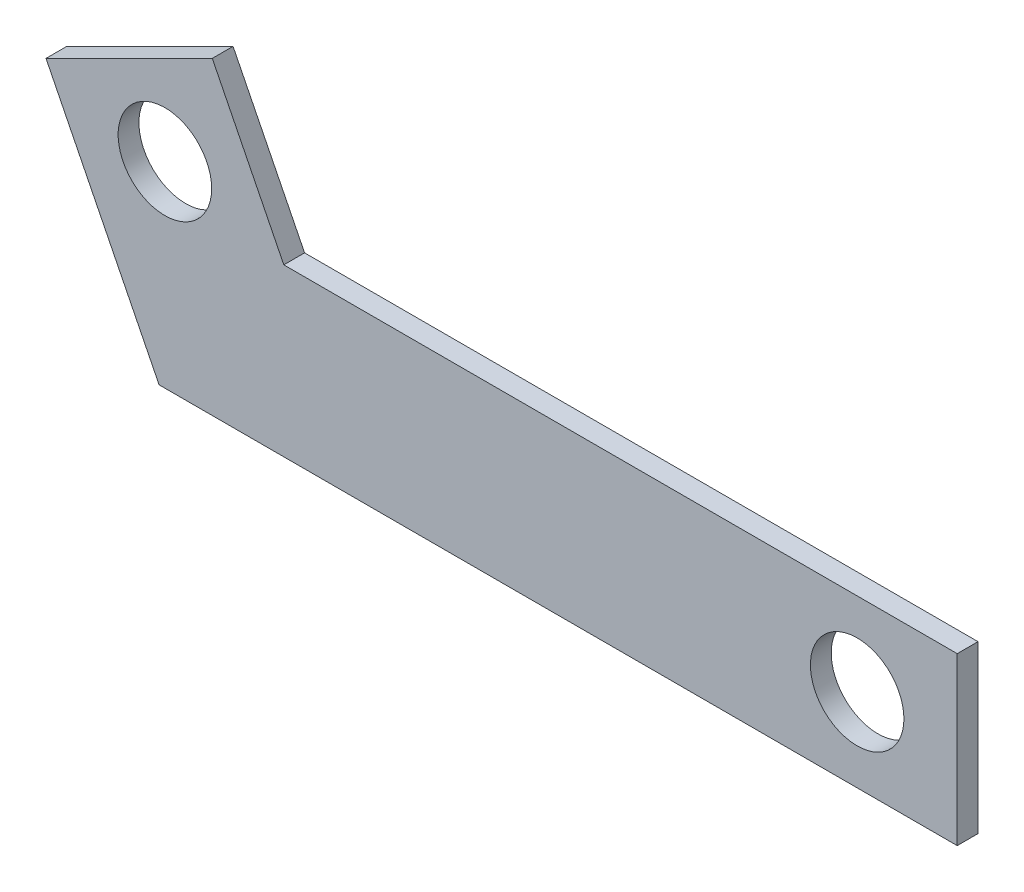
ISO-10303-21;
HEADER;
FILE_DESCRIPTION(('STEP AP214'),'2;1');
FILE_NAME('part.step','',(''),(''),'','','');
FILE_SCHEMA(('AUTOMOTIVE_DESIGN { 1 0 10303 214 1 1 1 1 }'));
ENDSEC;
DATA;
#1=APPLICATION_CONTEXT('core data for automotive mechanical design processes');
#2=APPLICATION_PROTOCOL_DEFINITION('international standard','automotive_design',2000,#1);
#3=PRODUCT_CONTEXT('',#1,'mechanical');
#4=PRODUCT('Part','Part','',(#3));
#5=PRODUCT_RELATED_PRODUCT_CATEGORY('part','',(#4));
#6=PRODUCT_DEFINITION_FORMATION('','',#4);
#7=PRODUCT_DEFINITION_CONTEXT('part definition',#1,'design');
#8=PRODUCT_DEFINITION('design','',#6,#7);
#9=PRODUCT_DEFINITION_SHAPE('','',#8);
#10=(LENGTH_UNIT() NAMED_UNIT(*) SI_UNIT(.MILLI.,.METRE.));
#11=(NAMED_UNIT(*) PLANE_ANGLE_UNIT() SI_UNIT($,.RADIAN.));
#12=(NAMED_UNIT(*) SI_UNIT($,.STERADIAN.) SOLID_ANGLE_UNIT());
#13=UNCERTAINTY_MEASURE_WITH_UNIT(LENGTH_MEASURE(1.E-05),#10,'distance_accuracy_value','');
#14=(GEOMETRIC_REPRESENTATION_CONTEXT(3) GLOBAL_UNCERTAINTY_ASSIGNED_CONTEXT((#13)) GLOBAL_UNIT_ASSIGNED_CONTEXT((#10,
#11,#12)) REPRESENTATION_CONTEXT('',''));
#15=CARTESIAN_POINT('',(0.,0.,0.));
#16=DIRECTION('',(0.,0.,1.));
#17=DIRECTION('',(1.,0.,0.));
#18=AXIS2_PLACEMENT_3D('',#15,#16,#17);
#19=CARTESIAN_POINT('',(104.05726693386,36.9026634810684,6.35));
#20=DIRECTION('',(0.,1.,0.));
#21=DIRECTION('',(-1.,0.,0.));
#22=AXIS2_PLACEMENT_3D('',#19,#20,#21);
#23=PLANE('',#22);
#24=DIRECTION('',(1.,0.,0.));
#25=VECTOR('',#24,1.);
#26=CARTESIAN_POINT('',(104.05726693386,36.9026634810684,0.));
#27=LINE('',#26,#25);
#28=CARTESIAN_POINT('',(-139.78273306614,36.9026634810684,0.));
#29=VERTEX_POINT('',#28);
#30=CARTESIAN_POINT('',(104.05726693386,36.9026634810684,0.));
#31=VERTEX_POINT('',#30);
#32=EDGE_CURVE('E128',#29,#31,#27,.T.);
#33=ORIENTED_EDGE('',*,*,#32,.T.);
#34=DIRECTION('',(0.,0.,-1.));
#35=VECTOR('',#34,1.);
#36=CARTESIAN_POINT('',(104.05726693386,36.9026634810684,6.35));
#37=LINE('',#36,#35);
#38=CARTESIAN_POINT('',(104.05726693386,36.9026634810684,6.35));
#39=VERTEX_POINT('',#38);
#40=EDGE_CURVE('E11',#39,#31,#37,.T.);
#41=ORIENTED_EDGE('',*,*,#40,.F.);
#42=DIRECTION('',(1.,0.,0.));
#43=VECTOR('',#42,1.);
#44=CARTESIAN_POINT('',(104.05726693386,36.9026634810684,6.35));
#45=LINE('',#44,#43);
#46=CARTESIAN_POINT('',(-139.78273306614,36.9026634810684,6.35));
#47=VERTEX_POINT('',#46);
#48=EDGE_CURVE('E145',#47,#39,#45,.T.);
#49=ORIENTED_EDGE('',*,*,#48,.F.);
#50=DIRECTION('',(0.,0.,-1.));
#51=VECTOR('',#50,1.);
#52=CARTESIAN_POINT('',(-139.78273306614,36.9026634810684,6.35));
#53=LINE('',#52,#51);
#54=EDGE_CURVE('E124',#47,#29,#53,.T.);
#55=ORIENTED_EDGE('',*,*,#54,.T.);
#56=EDGE_LOOP('',(#33,#41,#49,#55));
#57=FACE_BOUND('',#56,.T.);
#58=ADVANCED_FACE('F39',(#57),#23,.F.);
#59=CARTESIAN_POINT('',(104.05726693386,87.7026634810684,6.35));
#60=DIRECTION('',(-1.,0.,0.));
#61=DIRECTION('',(0.,-1.,0.));
#62=AXIS2_PLACEMENT_3D('',#59,#60,#61);
#63=PLANE('',#62);
#64=DIRECTION('',(0.,1.,0.));
#65=VECTOR('',#64,1.);
#66=CARTESIAN_POINT('',(104.05726693386,87.7026634810684,0.));
#67=LINE('',#66,#65);
#68=CARTESIAN_POINT('',(104.05726693386,87.7026634810684,0.));
#69=VERTEX_POINT('',#68);
#70=EDGE_CURVE('E132',#31,#69,#67,.T.);
#71=ORIENTED_EDGE('',*,*,#70,.T.);
#72=DIRECTION('',(0.,0.,-1.));
#73=VECTOR('',#72,1.);
#74=CARTESIAN_POINT('',(104.05726693386,87.7026634810684,6.35));
#75=LINE('',#74,#73);
#76=CARTESIAN_POINT('',(104.05726693386,87.7026634810684,6.35));
#77=VERTEX_POINT('',#76);
#78=EDGE_CURVE('E48',#77,#69,#75,.T.);
#79=ORIENTED_EDGE('',*,*,#78,.F.);
#80=DIRECTION('',(0.,1.,0.));
#81=VECTOR('',#80,1.);
#82=CARTESIAN_POINT('',(104.05726693386,87.7026634810684,6.35));
#83=LINE('',#82,#81);
#84=EDGE_CURVE('E93',#39,#77,#83,.T.);
#85=ORIENTED_EDGE('',*,*,#84,.F.);
#86=ORIENTED_EDGE('',*,*,#40,.T.);
#87=EDGE_LOOP('',(#71,#79,#85,#86));
#88=FACE_BOUND('',#87,.T.);
#89=ADVANCED_FACE('F174',(#88),#63,.F.);
#90=CARTESIAN_POINT('',(-101.68273306614,87.7026634810684,6.35));
#91=DIRECTION('',(0.,-1.,0.));
#92=DIRECTION('',(1.,0.,0.));
#93=AXIS2_PLACEMENT_3D('',#90,#91,#92);
#94=PLANE('',#93);
#95=DIRECTION('',(-1.,0.,0.));
#96=VECTOR('',#95,1.);
#97=CARTESIAN_POINT('',(-101.68273306614,87.7026634810684,0.));
#98=LINE('',#97,#96);
#99=CARTESIAN_POINT('',(-101.68273306614,87.7026634810684,0.));
#100=VERTEX_POINT('',#99);
#101=EDGE_CURVE('E136',#69,#100,#98,.T.);
#102=ORIENTED_EDGE('',*,*,#101,.T.);
#103=DIRECTION('',(0.,0.,-1.));
#104=VECTOR('',#103,1.);
#105=CARTESIAN_POINT('',(-101.68273306614,87.7026634810684,6.35));
#106=LINE('',#105,#104);
#107=CARTESIAN_POINT('',(-101.68273306614,87.7026634810684,6.35));
#108=VERTEX_POINT('',#107);
#109=EDGE_CURVE('E117',#108,#100,#106,.T.);
#110=ORIENTED_EDGE('',*,*,#109,.F.);
#111=DIRECTION('',(-1.,0.,0.));
#112=VECTOR('',#111,1.);
#113=CARTESIAN_POINT('',(-101.68273306614,87.7026634810684,6.35));
#114=LINE('',#113,#112);
#115=EDGE_CURVE('E106',#77,#108,#114,.T.);
#116=ORIENTED_EDGE('',*,*,#115,.F.);
#117=ORIENTED_EDGE('',*,*,#78,.T.);
#118=EDGE_LOOP('',(#102,#110,#116,#117));
#119=FACE_BOUND('',#118,.T.);
#120=ADVANCED_FACE('F155',(#119),#94,.F.);
#121=CARTESIAN_POINT('',(-123.536149065154,131.40948626681,6.35));
#122=DIRECTION('',(-0.894427153295411,-0.44721367090896,0.));
#123=DIRECTION('',(0.44721367090896,-0.894427153295411,0.));
#124=AXIS2_PLACEMENT_3D('',#121,#122,#123);
#125=PLANE('',#124);
#126=DIRECTION('',(-0.44721367090896,0.894427153295411,0.));
#127=VECTOR('',#126,1.);
#128=CARTESIAN_POINT('',(-123.536149065154,131.40948626681,0.));
#129=LINE('',#128,#127);
#130=CARTESIAN_POINT('',(-123.536149065154,131.40948626681,0.));
#131=VERTEX_POINT('',#130);
#132=EDGE_CURVE('E115',#100,#131,#129,.T.);
#133=ORIENTED_EDGE('',*,*,#132,.T.);
#134=DIRECTION('',(0.,0.,-1.));
#135=VECTOR('',#134,1.);
#136=CARTESIAN_POINT('',(-123.536149065154,131.40948626681,6.35));
#137=LINE('',#136,#135);
#138=CARTESIAN_POINT('',(-123.536149065154,131.40948626681,6.35));
#139=VERTEX_POINT('',#138);
#140=EDGE_CURVE('E112',#139,#131,#137,.T.);
#141=ORIENTED_EDGE('',*,*,#140,.F.);
#142=DIRECTION('',(-0.44721367090896,0.894427153295411,0.));
#143=VECTOR('',#142,1.);
#144=CARTESIAN_POINT('',(-123.536149065154,131.40948626681,6.35));
#145=LINE('',#144,#143);
#146=EDGE_CURVE('E100',#108,#139,#145,.T.);
#147=ORIENTED_EDGE('',*,*,#146,.F.);
#148=ORIENTED_EDGE('',*,*,#109,.T.);
#149=EDGE_LOOP('',(#133,#141,#147,#148));
#150=FACE_BOUND('',#149,.T.);
#151=ADVANCED_FACE('F113',(#150),#125,.F.);
#152=CARTESIAN_POINT('',(-174.336149065154,106.009480913136,6.35));
#153=DIRECTION('',(0.447213670908959,-0.894427153295411,0.));
#154=DIRECTION('',(0.894427153295411,0.447213670908959,0.));
#155=AXIS2_PLACEMENT_3D('',#152,#153,#154);
#156=PLANE('',#155);
#157=DIRECTION('',(-0.894427153295411,-0.447213670908959,0.));
#158=VECTOR('',#157,1.);
#159=CARTESIAN_POINT('',(-174.336149065154,106.009480913136,0.));
#160=LINE('',#159,#158);
#161=CARTESIAN_POINT('',(-174.336149065154,106.009480913136,0.));
#162=VERTEX_POINT('',#161);
#163=EDGE_CURVE('E79',#131,#162,#160,.T.);
#164=ORIENTED_EDGE('',*,*,#163,.T.);
#165=DIRECTION('',(0.,0.,-1.));
#166=VECTOR('',#165,1.);
#167=CARTESIAN_POINT('',(-174.336149065154,106.009480913136,6.35));
#168=LINE('',#167,#166);
#169=CARTESIAN_POINT('',(-174.336149065154,106.009480913136,6.35));
#170=VERTEX_POINT('',#169);
#171=EDGE_CURVE('E118',#170,#162,#168,.T.);
#172=ORIENTED_EDGE('',*,*,#171,.F.);
#173=DIRECTION('',(-0.894427153295411,-0.447213670908959,0.));
#174=VECTOR('',#173,1.);
#175=CARTESIAN_POINT('',(-174.336149065154,106.009480913136,6.35));
#176=LINE('',#175,#174);
#177=EDGE_CURVE('E104',#139,#170,#176,.T.);
#178=ORIENTED_EDGE('',*,*,#177,.F.);
#179=ORIENTED_EDGE('',*,*,#140,.T.);
#180=EDGE_LOOP('',(#164,#172,#178,#179));
#181=FACE_BOUND('',#180,.T.);
#182=ADVANCED_FACE('F120',(#181),#156,.F.);
#183=CARTESIAN_POINT('',(-139.78273306614,36.9026634810684,6.35));
#184=DIRECTION('',(0.894427153295411,0.44721367090896,0.));
#185=DIRECTION('',(-0.44721367090896,0.894427153295411,0.));
#186=AXIS2_PLACEMENT_3D('',#183,#184,#185);
#187=PLANE('',#186);
#188=DIRECTION('',(0.44721367090896,-0.894427153295411,0.));
#189=VECTOR('',#188,1.);
#190=CARTESIAN_POINT('',(-139.78273306614,36.9026634810684,0.));
#191=LINE('',#190,#189);
#192=EDGE_CURVE('E85',#162,#29,#191,.T.);
#193=ORIENTED_EDGE('',*,*,#192,.T.);
#194=ORIENTED_EDGE('',*,*,#54,.F.);
#195=DIRECTION('',(0.44721367090896,-0.894427153295411,0.));
#196=VECTOR('',#195,1.);
#197=CARTESIAN_POINT('',(-139.78273306614,36.9026634810684,6.35));
#198=LINE('',#197,#196);
#199=EDGE_CURVE('E56',#170,#47,#198,.T.);
#200=ORIENTED_EDGE('',*,*,#199,.F.);
#201=ORIENTED_EDGE('',*,*,#171,.T.);
#202=EDGE_LOOP('',(#193,#194,#200,#201));
#203=FACE_BOUND('',#202,.T.);
#204=ADVANCED_FACE('F162',(#203),#187,.F.);
#205=CARTESIAN_POINT('',(0.,0.,6.35));
#206=DIRECTION('',(0.,0.,1.));
#207=DIRECTION('',(1.,0.,0.));
#208=AXIS2_PLACEMENT_3D('',#205,#206,#207);
#209=PLANE('',#208);
#210=CARTESIAN_POINT('',(73.4903072614112,62.3026634810684,6.35));
#211=DIRECTION('',(0.,0.,1.));
#212=DIRECTION('',(1.,0.,0.));
#213=AXIS2_PLACEMENT_3D('',#210,#211,#212);
#214=CIRCLE('',#213,14.2875);
#215=CARTESIAN_POINT('',(87.7778072614112,62.3026634810684,6.35));
#216=VERTEX_POINT('',#215);
#217=EDGE_CURVE('E239',#216,#216,#214,.T.);
#218=ORIENTED_EDGE('',*,*,#217,.F.);
#219=EDGE_LOOP('',(#218));
#220=FACE_BOUND('',#219,.T.);
#221=CARTESIAN_POINT('',(-138.009441065647,96.8560721971021,6.35));
#222=DIRECTION('',(0.,0.,1.));
#223=DIRECTION('',(1.,0.,0.));
#224=AXIS2_PLACEMENT_3D('',#221,#222,#223);
#225=CIRCLE('',#224,14.2875);
#226=CARTESIAN_POINT('',(-123.721941065647,96.8560721971021,6.35));
#227=VERTEX_POINT('',#226);
#228=EDGE_CURVE('E247',#227,#227,#225,.T.);
#229=ORIENTED_EDGE('',*,*,#228,.F.);
#230=EDGE_LOOP('',(#229));
#231=FACE_BOUND('',#230,.T.);
#232=ORIENTED_EDGE('',*,*,#48,.T.);
#233=ORIENTED_EDGE('',*,*,#84,.T.);
#234=ORIENTED_EDGE('',*,*,#115,.T.);
#235=ORIENTED_EDGE('',*,*,#146,.T.);
#236=ORIENTED_EDGE('',*,*,#177,.T.);
#237=ORIENTED_EDGE('',*,*,#199,.T.);
#238=EDGE_LOOP('',(#232,#233,#234,#235,#236,#237));
#239=FACE_BOUND('',#238,.T.);
#240=ADVANCED_FACE('F102',(#220,#231,#239),#209,.T.);
#241=CARTESIAN_POINT('',(0.,0.,0.));
#242=DIRECTION('',(0.,0.,1.));
#243=DIRECTION('',(1.,0.,0.));
#244=AXIS2_PLACEMENT_3D('',#241,#242,#243);
#245=PLANE('',#244);
#246=CARTESIAN_POINT('',(73.4903072614112,62.3026634810684,0.));
#247=DIRECTION('',(0.,0.,1.));
#248=DIRECTION('',(1.,0.,0.));
#249=AXIS2_PLACEMENT_3D('',#246,#247,#248);
#250=CIRCLE('',#249,14.2875);
#251=CARTESIAN_POINT('',(87.7778072614112,62.3026634810684,0.));
#252=VERTEX_POINT('',#251);
#253=EDGE_CURVE('E133',#252,#252,#250,.T.);
#254=ORIENTED_EDGE('',*,*,#253,.T.);
#255=EDGE_LOOP('',(#254));
#256=FACE_BOUND('',#255,.T.);
#257=CARTESIAN_POINT('',(-138.009441065647,96.8560721971021,0.));
#258=DIRECTION('',(0.,0.,1.));
#259=DIRECTION('',(1.,0.,0.));
#260=AXIS2_PLACEMENT_3D('',#257,#258,#259);
#261=CIRCLE('',#260,14.2875);
#262=CARTESIAN_POINT('',(-123.721941065647,96.8560721971021,0.));
#263=VERTEX_POINT('',#262);
#264=EDGE_CURVE('E241',#263,#263,#261,.T.);
#265=ORIENTED_EDGE('',*,*,#264,.T.);
#266=EDGE_LOOP('',(#265));
#267=FACE_BOUND('',#266,.T.);
#268=ORIENTED_EDGE('',*,*,#32,.F.);
#269=ORIENTED_EDGE('',*,*,#192,.F.);
#270=ORIENTED_EDGE('',*,*,#163,.F.);
#271=ORIENTED_EDGE('',*,*,#132,.F.);
#272=ORIENTED_EDGE('',*,*,#101,.F.);
#273=ORIENTED_EDGE('',*,*,#70,.F.);
#274=EDGE_LOOP('',(#268,#269,#270,#271,#272,#273));
#275=FACE_BOUND('',#274,.T.);
#276=ADVANCED_FACE('F158',(#256,#267,#275),#245,.F.);
#277=CARTESIAN_POINT('',(-138.009441065647,96.8560721971021,0.));
#278=DIRECTION('',(0.,0.,1.));
#279=DIRECTION('',(1.,0.,0.));
#280=AXIS2_PLACEMENT_3D('',#277,#278,#279);
#281=CYLINDRICAL_SURFACE('',#280,14.2875);
#282=ORIENTED_EDGE('',*,*,#264,.F.);
#283=EDGE_LOOP('',(#282));
#284=FACE_BOUND('',#283,.T.);
#285=ORIENTED_EDGE('',*,*,#228,.T.);
#286=EDGE_LOOP('',(#285));
#287=FACE_BOUND('',#286,.T.);
#288=ADVANCED_FACE('F211',(#284,#287),#281,.F.);
#289=CARTESIAN_POINT('',(73.4903072614112,62.3026634810684,0.));
#290=DIRECTION('',(0.,0.,1.));
#291=DIRECTION('',(1.,0.,0.));
#292=AXIS2_PLACEMENT_3D('',#289,#290,#291);
#293=CYLINDRICAL_SURFACE('',#292,14.2875);
#294=ORIENTED_EDGE('',*,*,#253,.F.);
#295=EDGE_LOOP('',(#294));
#296=FACE_BOUND('',#295,.T.);
#297=ORIENTED_EDGE('',*,*,#217,.T.);
#298=EDGE_LOOP('',(#297));
#299=FACE_BOUND('',#298,.T.);
#300=ADVANCED_FACE('F220',(#296,#299),#293,.F.);
#301=CLOSED_SHELL('',(#58,#89,#120,#151,#182,#204,#240,#276,#288,#300));
#302=MANIFOLD_SOLID_BREP('B2',#301);
#303=ADVANCED_BREP_SHAPE_REPRESENTATION('',(#18,#302),#14);
#304=SHAPE_DEFINITION_REPRESENTATION(#9,#303);
ENDSEC;
END-ISO-10303-21;
